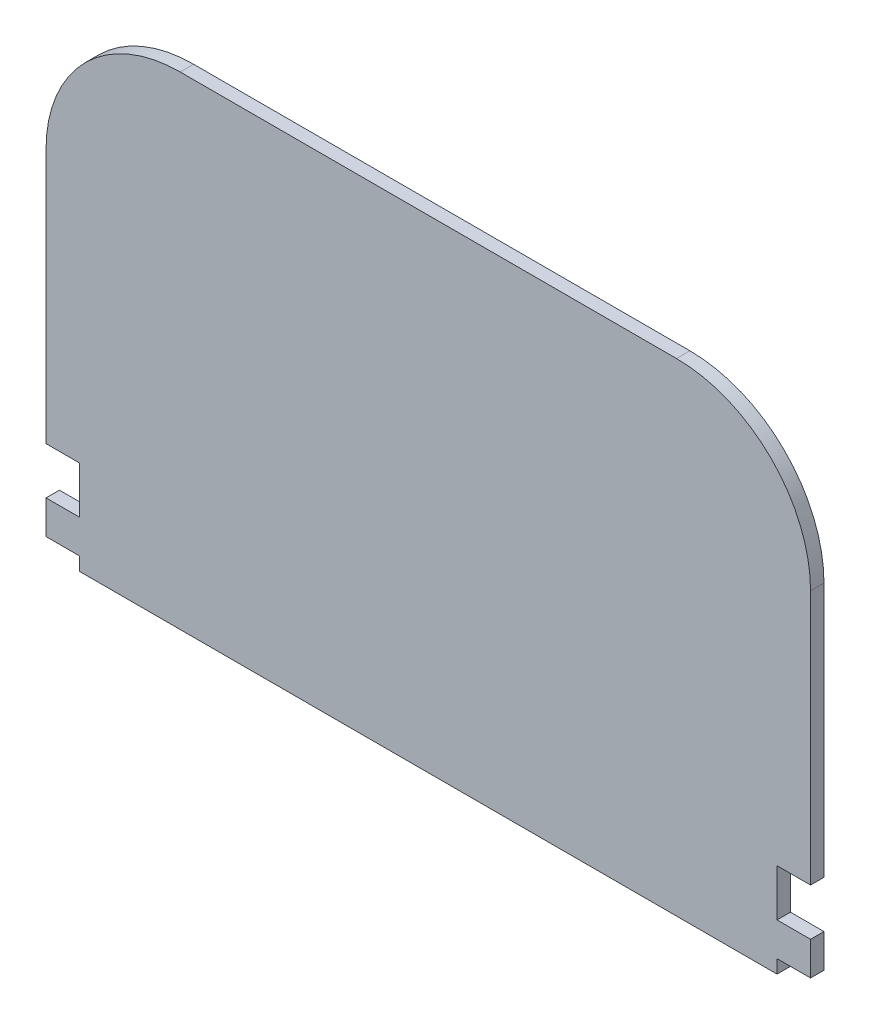
ISO-10303-21;
HEADER;
FILE_DESCRIPTION(('STEP AP214'),'2;1');
FILE_NAME('part.step','',(''),(''),'','','');
FILE_SCHEMA(('AUTOMOTIVE_DESIGN { 1 0 10303 214 1 1 1 1 }'));
ENDSEC;
DATA;
#1=APPLICATION_CONTEXT('core data for automotive mechanical design processes');
#2=APPLICATION_PROTOCOL_DEFINITION('international standard','automotive_design',2000,#1);
#3=PRODUCT_CONTEXT('',#1,'mechanical');
#4=PRODUCT('Part','Part','',(#3));
#5=PRODUCT_RELATED_PRODUCT_CATEGORY('part','',(#4));
#6=PRODUCT_DEFINITION_FORMATION('','',#4);
#7=PRODUCT_DEFINITION_CONTEXT('part definition',#1,'design');
#8=PRODUCT_DEFINITION('design','',#6,#7);
#9=PRODUCT_DEFINITION_SHAPE('','',#8);
#10=(LENGTH_UNIT() NAMED_UNIT(*) SI_UNIT(.MILLI.,.METRE.));
#11=(NAMED_UNIT(*) PLANE_ANGLE_UNIT() SI_UNIT($,.RADIAN.));
#12=(NAMED_UNIT(*) SI_UNIT($,.STERADIAN.) SOLID_ANGLE_UNIT());
#13=UNCERTAINTY_MEASURE_WITH_UNIT(LENGTH_MEASURE(1.E-05),#10,'distance_accuracy_value','');
#14=(GEOMETRIC_REPRESENTATION_CONTEXT(3) GLOBAL_UNCERTAINTY_ASSIGNED_CONTEXT((#13)) GLOBAL_UNIT_ASSIGNED_CONTEXT((#10,
#11,#12)) REPRESENTATION_CONTEXT('',''));
#15=CARTESIAN_POINT('',(0.,0.,0.));
#16=DIRECTION('',(0.,0.,1.));
#17=DIRECTION('',(1.,0.,0.));
#18=AXIS2_PLACEMENT_3D('',#15,#16,#17);
#19=CARTESIAN_POINT('',(47.,26.,1.));
#20=DIRECTION('',(0.,0.,-1.));
#21=DIRECTION('',(-1.,0.,0.));
#22=AXIS2_PLACEMENT_3D('',#19,#20,#21);
#23=CYLINDRICAL_SURFACE('',#22,10.);
#24=CARTESIAN_POINT('',(47.,26.,0.));
#25=DIRECTION('',(0.,0.,1.));
#26=DIRECTION('',(-1.,0.,0.));
#27=AXIS2_PLACEMENT_3D('',#24,#25,#26);
#28=CIRCLE('',#27,10.);
#29=CARTESIAN_POINT('',(57.,25.9999999999999,0.));
#30=VERTEX_POINT('',#29);
#31=CARTESIAN_POINT('',(46.9999999999999,36.,0.));
#32=VERTEX_POINT('',#31);
#33=EDGE_CURVE('E186',#30,#32,#28,.T.);
#34=ORIENTED_EDGE('',*,*,#33,.T.);
#35=DIRECTION('',(0.,0.,-1.));
#36=VECTOR('',#35,1.);
#37=CARTESIAN_POINT('',(46.9999999999999,36.,1.));
#38=LINE('',#37,#36);
#39=CARTESIAN_POINT('',(46.9999999999999,36.,1.));
#40=VERTEX_POINT('',#39);
#41=EDGE_CURVE('E11',#40,#32,#38,.T.);
#42=ORIENTED_EDGE('',*,*,#41,.F.);
#43=CARTESIAN_POINT('',(47.,26.,1.));
#44=DIRECTION('',(0.,0.,1.));
#45=DIRECTION('',(-1.,0.,0.));
#46=AXIS2_PLACEMENT_3D('',#43,#44,#45);
#47=CIRCLE('',#46,10.);
#48=CARTESIAN_POINT('',(57.,25.9999999999999,1.));
#49=VERTEX_POINT('',#48);
#50=EDGE_CURVE('E220',#49,#40,#47,.T.);
#51=ORIENTED_EDGE('',*,*,#50,.F.);
#52=DIRECTION('',(0.,0.,-1.));
#53=VECTOR('',#52,1.);
#54=CARTESIAN_POINT('',(57.,25.9999999999999,1.));
#55=LINE('',#54,#53);
#56=EDGE_CURVE('E182',#49,#30,#55,.T.);
#57=ORIENTED_EDGE('',*,*,#56,.T.);
#58=EDGE_LOOP('',(#34,#42,#51,#57));
#59=FACE_BOUND('',#58,.T.);
#60=ADVANCED_FACE('F30',(#59),#23,.T.);
#61=CARTESIAN_POINT('',(10.0000000000001,36.,1.));
#62=DIRECTION('',(0.,-1.,0.));
#63=DIRECTION('',(0.,0.,-1.));
#64=AXIS2_PLACEMENT_3D('',#61,#62,#63);
#65=PLANE('',#64);
#66=DIRECTION('',(-1.,0.,0.));
#67=VECTOR('',#66,1.);
#68=CARTESIAN_POINT('',(10.0000000000001,36.,0.));
#69=LINE('',#68,#67);
#70=CARTESIAN_POINT('',(10.0000000000001,36.,0.));
#71=VERTEX_POINT('',#70);
#72=EDGE_CURVE('E189',#32,#71,#69,.T.);
#73=ORIENTED_EDGE('',*,*,#72,.T.);
#74=DIRECTION('',(0.,0.,-1.));
#75=VECTOR('',#74,1.);
#76=CARTESIAN_POINT('',(10.0000000000001,36.,1.));
#77=LINE('',#76,#75);
#78=CARTESIAN_POINT('',(10.0000000000001,36.,1.));
#79=VERTEX_POINT('',#78);
#80=EDGE_CURVE('E38',#79,#71,#77,.T.);
#81=ORIENTED_EDGE('',*,*,#80,.F.);
#82=DIRECTION('',(-1.,0.,0.));
#83=VECTOR('',#82,1.);
#84=CARTESIAN_POINT('',(10.0000000000001,36.,1.));
#85=LINE('',#84,#83);
#86=EDGE_CURVE('E119',#40,#79,#85,.T.);
#87=ORIENTED_EDGE('',*,*,#86,.F.);
#88=ORIENTED_EDGE('',*,*,#41,.T.);
#89=EDGE_LOOP('',(#73,#81,#87,#88));
#90=FACE_BOUND('',#89,.T.);
#91=ADVANCED_FACE('F328',(#90),#65,.F.);
#92=CARTESIAN_POINT('',(10.,26.,1.));
#93=DIRECTION('',(0.,0.,-1.));
#94=DIRECTION('',(-1.,0.,0.));
#95=AXIS2_PLACEMENT_3D('',#92,#93,#94);
#96=CYLINDRICAL_SURFACE('',#95,10.);
#97=CARTESIAN_POINT('',(10.,26.,0.));
#98=DIRECTION('',(0.,0.,1.));
#99=DIRECTION('',(1.,0.,0.));
#100=AXIS2_PLACEMENT_3D('',#97,#98,#99);
#101=CIRCLE('',#100,10.);
#102=CARTESIAN_POINT('',(0.,25.9999999999999,0.));
#103=VERTEX_POINT('',#102);
#104=EDGE_CURVE('E191',#71,#103,#101,.T.);
#105=ORIENTED_EDGE('',*,*,#104,.T.);
#106=DIRECTION('',(0.,0.,-1.));
#107=VECTOR('',#106,1.);
#108=CARTESIAN_POINT('',(0.,25.9999999999999,1.));
#109=LINE('',#108,#107);
#110=CARTESIAN_POINT('',(0.,25.9999999999999,1.));
#111=VERTEX_POINT('',#110);
#112=EDGE_CURVE('E257',#111,#103,#109,.T.);
#113=ORIENTED_EDGE('',*,*,#112,.F.);
#114=CARTESIAN_POINT('',(10.,26.,1.));
#115=DIRECTION('',(0.,0.,1.));
#116=DIRECTION('',(1.,0.,0.));
#117=AXIS2_PLACEMENT_3D('',#114,#115,#116);
#118=CIRCLE('',#117,10.);
#119=EDGE_CURVE('E265',#79,#111,#118,.T.);
#120=ORIENTED_EDGE('',*,*,#119,.F.);
#121=ORIENTED_EDGE('',*,*,#80,.T.);
#122=EDGE_LOOP('',(#105,#113,#120,#121));
#123=FACE_BOUND('',#122,.T.);
#124=ADVANCED_FACE('F263',(#123),#96,.T.);
#125=CARTESIAN_POINT('',(0.,7.,1.));
#126=DIRECTION('',(1.,0.,0.));
#127=DIRECTION('',(0.,0.,-1.));
#128=AXIS2_PLACEMENT_3D('',#125,#126,#127);
#129=PLANE('',#128);
#130=DIRECTION('',(0.,-1.,0.));
#131=VECTOR('',#130,1.);
#132=CARTESIAN_POINT('',(0.,7.,0.));
#133=LINE('',#132,#131);
#134=CARTESIAN_POINT('',(0.,7.,0.));
#135=VERTEX_POINT('',#134);
#136=EDGE_CURVE('E193',#103,#135,#133,.T.);
#137=ORIENTED_EDGE('',*,*,#136,.T.);
#138=DIRECTION('',(0.,0.,-1.));
#139=VECTOR('',#138,1.);
#140=CARTESIAN_POINT('',(0.,7.,1.));
#141=LINE('',#140,#139);
#142=CARTESIAN_POINT('',(0.,7.,1.));
#143=VERTEX_POINT('',#142);
#144=EDGE_CURVE('E254',#143,#135,#141,.T.);
#145=ORIENTED_EDGE('',*,*,#144,.F.);
#146=DIRECTION('',(0.,-1.,0.));
#147=VECTOR('',#146,1.);
#148=CARTESIAN_POINT('',(0.,7.,1.));
#149=LINE('',#148,#147);
#150=EDGE_CURVE('E283',#111,#143,#149,.T.);
#151=ORIENTED_EDGE('',*,*,#150,.F.);
#152=ORIENTED_EDGE('',*,*,#112,.T.);
#153=EDGE_LOOP('',(#137,#145,#151,#152));
#154=FACE_BOUND('',#153,.T.);
#155=ADVANCED_FACE('F274',(#154),#129,.F.);
#156=CARTESIAN_POINT('',(0.,7.,1.));
#157=DIRECTION('',(0.,1.,0.));
#158=DIRECTION('',(0.,0.,1.));
#159=AXIS2_PLACEMENT_3D('',#156,#157,#158);
#160=PLANE('',#159);
#161=DIRECTION('',(1.,0.,0.));
#162=VECTOR('',#161,1.);
#163=CARTESIAN_POINT('',(0.,7.,0.));
#164=LINE('',#163,#162);
#165=CARTESIAN_POINT('',(2.5,7.,0.));
#166=VERTEX_POINT('',#165);
#167=EDGE_CURVE('E195',#135,#166,#164,.T.);
#168=ORIENTED_EDGE('',*,*,#167,.T.);
#169=DIRECTION('',(0.,0.,-1.));
#170=VECTOR('',#169,1.);
#171=CARTESIAN_POINT('',(2.5,7.,1.));
#172=LINE('',#171,#170);
#173=CARTESIAN_POINT('',(2.5,7.,1.));
#174=VERTEX_POINT('',#173);
#175=EDGE_CURVE('E251',#174,#166,#172,.T.);
#176=ORIENTED_EDGE('',*,*,#175,.F.);
#177=DIRECTION('',(1.,0.,0.));
#178=VECTOR('',#177,1.);
#179=CARTESIAN_POINT('',(0.,7.,1.));
#180=LINE('',#179,#178);
#181=EDGE_CURVE('E280',#143,#174,#180,.T.);
#182=ORIENTED_EDGE('',*,*,#181,.F.);
#183=ORIENTED_EDGE('',*,*,#144,.T.);
#184=EDGE_LOOP('',(#168,#176,#182,#183));
#185=FACE_BOUND('',#184,.T.);
#186=ADVANCED_FACE('F278',(#185),#160,.F.);
#187=CARTESIAN_POINT('',(2.5,3.5,1.));
#188=DIRECTION('',(1.,0.,0.));
#189=DIRECTION('',(0.,0.,-1.));
#190=AXIS2_PLACEMENT_3D('',#187,#188,#189);
#191=PLANE('',#190);
#192=DIRECTION('',(0.,-1.,0.));
#193=VECTOR('',#192,1.);
#194=CARTESIAN_POINT('',(2.5,3.5,0.));
#195=LINE('',#194,#193);
#196=CARTESIAN_POINT('',(2.5,3.5,0.));
#197=VERTEX_POINT('',#196);
#198=EDGE_CURVE('E197',#166,#197,#195,.T.);
#199=ORIENTED_EDGE('',*,*,#198,.T.);
#200=DIRECTION('',(0.,0.,-1.));
#201=VECTOR('',#200,1.);
#202=CARTESIAN_POINT('',(2.5,3.5,1.));
#203=LINE('',#202,#201);
#204=CARTESIAN_POINT('',(2.5,3.5,1.));
#205=VERTEX_POINT('',#204);
#206=EDGE_CURVE('E248',#205,#197,#203,.T.);
#207=ORIENTED_EDGE('',*,*,#206,.F.);
#208=DIRECTION('',(0.,-1.,0.));
#209=VECTOR('',#208,1.);
#210=CARTESIAN_POINT('',(2.5,3.5,1.));
#211=LINE('',#210,#209);
#212=EDGE_CURVE('E282',#174,#205,#211,.T.);
#213=ORIENTED_EDGE('',*,*,#212,.F.);
#214=ORIENTED_EDGE('',*,*,#175,.T.);
#215=EDGE_LOOP('',(#199,#207,#213,#214));
#216=FACE_BOUND('',#215,.T.);
#217=ADVANCED_FACE('F341',(#216),#191,.F.);
#218=CARTESIAN_POINT('',(0.,3.5,1.));
#219=DIRECTION('',(0.,-1.,0.));
#220=DIRECTION('',(0.,0.,-1.));
#221=AXIS2_PLACEMENT_3D('',#218,#219,#220);
#222=PLANE('',#221);
#223=DIRECTION('',(-1.,0.,0.));
#224=VECTOR('',#223,1.);
#225=CARTESIAN_POINT('',(0.,3.5,0.));
#226=LINE('',#225,#224);
#227=CARTESIAN_POINT('',(0.,3.5,0.));
#228=VERTEX_POINT('',#227);
#229=EDGE_CURVE('E199',#197,#228,#226,.T.);
#230=ORIENTED_EDGE('',*,*,#229,.T.);
#231=DIRECTION('',(0.,0.,-1.));
#232=VECTOR('',#231,1.);
#233=CARTESIAN_POINT('',(0.,3.5,1.));
#234=LINE('',#233,#232);
#235=CARTESIAN_POINT('',(0.,3.5,1.));
#236=VERTEX_POINT('',#235);
#237=EDGE_CURVE('E245',#236,#228,#234,.T.);
#238=ORIENTED_EDGE('',*,*,#237,.F.);
#239=DIRECTION('',(-1.,0.,0.));
#240=VECTOR('',#239,1.);
#241=CARTESIAN_POINT('',(0.,3.5,1.));
#242=LINE('',#241,#240);
#243=EDGE_CURVE('E285',#205,#236,#242,.T.);
#244=ORIENTED_EDGE('',*,*,#243,.F.);
#245=ORIENTED_EDGE('',*,*,#206,.T.);
#246=EDGE_LOOP('',(#230,#238,#244,#245));
#247=FACE_BOUND('',#246,.T.);
#248=ADVANCED_FACE('F344',(#247),#222,.F.);
#249=CARTESIAN_POINT('',(0.,1.,1.));
#250=DIRECTION('',(1.,0.,0.));
#251=DIRECTION('',(0.,0.,-1.));
#252=AXIS2_PLACEMENT_3D('',#249,#250,#251);
#253=PLANE('',#252);
#254=DIRECTION('',(0.,-1.,0.));
#255=VECTOR('',#254,1.);
#256=CARTESIAN_POINT('',(0.,1.,0.));
#257=LINE('',#256,#255);
#258=CARTESIAN_POINT('',(0.,1.,0.));
#259=VERTEX_POINT('',#258);
#260=EDGE_CURVE('E201',#228,#259,#257,.T.);
#261=ORIENTED_EDGE('',*,*,#260,.T.);
#262=DIRECTION('',(0.,0.,-1.));
#263=VECTOR('',#262,1.);
#264=CARTESIAN_POINT('',(0.,1.,1.));
#265=LINE('',#264,#263);
#266=CARTESIAN_POINT('',(0.,1.,1.));
#267=VERTEX_POINT('',#266);
#268=EDGE_CURVE('E242',#267,#259,#265,.T.);
#269=ORIENTED_EDGE('',*,*,#268,.F.);
#270=DIRECTION('',(0.,-1.,0.));
#271=VECTOR('',#270,1.);
#272=CARTESIAN_POINT('',(0.,1.,1.));
#273=LINE('',#272,#271);
#274=EDGE_CURVE('E291',#236,#267,#273,.T.);
#275=ORIENTED_EDGE('',*,*,#274,.F.);
#276=ORIENTED_EDGE('',*,*,#237,.T.);
#277=EDGE_LOOP('',(#261,#269,#275,#276));
#278=FACE_BOUND('',#277,.T.);
#279=ADVANCED_FACE('F348',(#278),#253,.F.);
#280=CARTESIAN_POINT('',(0.,1.,1.));
#281=DIRECTION('',(0.,1.,0.));
#282=DIRECTION('',(0.,0.,1.));
#283=AXIS2_PLACEMENT_3D('',#280,#281,#282);
#284=PLANE('',#283);
#285=DIRECTION('',(1.,0.,0.));
#286=VECTOR('',#285,1.);
#287=CARTESIAN_POINT('',(0.,1.,0.));
#288=LINE('',#287,#286);
#289=CARTESIAN_POINT('',(2.5,1.,0.));
#290=VERTEX_POINT('',#289);
#291=EDGE_CURVE('E203',#259,#290,#288,.T.);
#292=ORIENTED_EDGE('',*,*,#291,.T.);
#293=DIRECTION('',(0.,0.,-1.));
#294=VECTOR('',#293,1.);
#295=CARTESIAN_POINT('',(2.5,1.,1.));
#296=LINE('',#295,#294);
#297=CARTESIAN_POINT('',(2.5,1.,1.));
#298=VERTEX_POINT('',#297);
#299=EDGE_CURVE('E239',#298,#290,#296,.T.);
#300=ORIENTED_EDGE('',*,*,#299,.F.);
#301=DIRECTION('',(1.,0.,0.));
#302=VECTOR('',#301,1.);
#303=CARTESIAN_POINT('',(0.,1.,1.));
#304=LINE('',#303,#302);
#305=EDGE_CURVE('E293',#267,#298,#304,.T.);
#306=ORIENTED_EDGE('',*,*,#305,.F.);
#307=ORIENTED_EDGE('',*,*,#268,.T.);
#308=EDGE_LOOP('',(#292,#300,#306,#307));
#309=FACE_BOUND('',#308,.T.);
#310=ADVANCED_FACE('F352',(#309),#284,.F.);
#311=CARTESIAN_POINT('',(2.5,0.,1.));
#312=DIRECTION('',(1.,0.,0.));
#313=DIRECTION('',(0.,1.,0.));
#314=AXIS2_PLACEMENT_3D('',#311,#312,#313);
#315=PLANE('',#314);
#316=DIRECTION('',(0.,-1.,0.));
#317=VECTOR('',#316,1.);
#318=CARTESIAN_POINT('',(2.5,0.,0.));
#319=LINE('',#318,#317);
#320=CARTESIAN_POINT('',(2.5,0.,0.));
#321=VERTEX_POINT('',#320);
#322=EDGE_CURVE('E205',#290,#321,#319,.T.);
#323=ORIENTED_EDGE('',*,*,#322,.T.);
#324=DIRECTION('',(0.,0.,-1.));
#325=VECTOR('',#324,1.);
#326=CARTESIAN_POINT('',(2.5,0.,1.));
#327=LINE('',#326,#325);
#328=CARTESIAN_POINT('',(2.5,0.,1.));
#329=VERTEX_POINT('',#328);
#330=EDGE_CURVE('E236',#329,#321,#327,.T.);
#331=ORIENTED_EDGE('',*,*,#330,.F.);
#332=DIRECTION('',(0.,-1.,0.));
#333=VECTOR('',#332,1.);
#334=CARTESIAN_POINT('',(2.5,0.,1.));
#335=LINE('',#334,#333);
#336=EDGE_CURVE('E295',#298,#329,#335,.T.);
#337=ORIENTED_EDGE('',*,*,#336,.F.);
#338=ORIENTED_EDGE('',*,*,#299,.T.);
#339=EDGE_LOOP('',(#323,#331,#337,#338));
#340=FACE_BOUND('',#339,.T.);
#341=ADVANCED_FACE('F356',(#340),#315,.F.);
#342=CARTESIAN_POINT('',(2.5,0.,1.));
#343=DIRECTION('',(0.,1.,0.));
#344=DIRECTION('',(0.,0.,1.));
#345=AXIS2_PLACEMENT_3D('',#342,#343,#344);
#346=PLANE('',#345);
#347=DIRECTION('',(1.,0.,0.));
#348=VECTOR('',#347,1.);
#349=CARTESIAN_POINT('',(2.5,0.,0.));
#350=LINE('',#349,#348);
#351=CARTESIAN_POINT('',(54.5,0.,0.));
#352=VERTEX_POINT('',#351);
#353=EDGE_CURVE('E207',#321,#352,#350,.T.);
#354=ORIENTED_EDGE('',*,*,#353,.T.);
#355=DIRECTION('',(0.,0.,-1.));
#356=VECTOR('',#355,1.);
#357=CARTESIAN_POINT('',(54.5,0.,1.));
#358=LINE('',#357,#356);
#359=CARTESIAN_POINT('',(54.5,0.,1.));
#360=VERTEX_POINT('',#359);
#361=EDGE_CURVE('E233',#360,#352,#358,.T.);
#362=ORIENTED_EDGE('',*,*,#361,.F.);
#363=DIRECTION('',(1.,0.,0.));
#364=VECTOR('',#363,1.);
#365=CARTESIAN_POINT('',(2.5,0.,1.));
#366=LINE('',#365,#364);
#367=EDGE_CURVE('E297',#329,#360,#366,.T.);
#368=ORIENTED_EDGE('',*,*,#367,.F.);
#369=ORIENTED_EDGE('',*,*,#330,.T.);
#370=EDGE_LOOP('',(#354,#362,#368,#369));
#371=FACE_BOUND('',#370,.T.);
#372=ADVANCED_FACE('F360',(#371),#346,.F.);
#373=CARTESIAN_POINT('',(54.5,0.,1.));
#374=DIRECTION('',(-1.,0.,0.));
#375=DIRECTION('',(0.,-1.,0.));
#376=AXIS2_PLACEMENT_3D('',#373,#374,#375);
#377=PLANE('',#376);
#378=DIRECTION('',(0.,1.,0.));
#379=VECTOR('',#378,1.);
#380=CARTESIAN_POINT('',(54.5,0.,0.));
#381=LINE('',#380,#379);
#382=CARTESIAN_POINT('',(54.5,1.,0.));
#383=VERTEX_POINT('',#382);
#384=EDGE_CURVE('E209',#352,#383,#381,.T.);
#385=ORIENTED_EDGE('',*,*,#384,.T.);
#386=DIRECTION('',(0.,0.,-1.));
#387=VECTOR('',#386,1.);
#388=CARTESIAN_POINT('',(54.5,1.,1.));
#389=LINE('',#388,#387);
#390=CARTESIAN_POINT('',(54.5,1.,1.));
#391=VERTEX_POINT('',#390);
#392=EDGE_CURVE('E230',#391,#383,#389,.T.);
#393=ORIENTED_EDGE('',*,*,#392,.F.);
#394=DIRECTION('',(0.,1.,0.));
#395=VECTOR('',#394,1.);
#396=CARTESIAN_POINT('',(54.5,0.,1.));
#397=LINE('',#396,#395);
#398=EDGE_CURVE('E299',#360,#391,#397,.T.);
#399=ORIENTED_EDGE('',*,*,#398,.F.);
#400=ORIENTED_EDGE('',*,*,#361,.T.);
#401=EDGE_LOOP('',(#385,#393,#399,#400));
#402=FACE_BOUND('',#401,.T.);
#403=ADVANCED_FACE('F364',(#402),#377,.F.);
#404=CARTESIAN_POINT('',(54.5,1.,1.));
#405=DIRECTION('',(0.,1.,0.));
#406=DIRECTION('',(0.,0.,1.));
#407=AXIS2_PLACEMENT_3D('',#404,#405,#406);
#408=PLANE('',#407);
#409=DIRECTION('',(1.,0.,0.));
#410=VECTOR('',#409,1.);
#411=CARTESIAN_POINT('',(54.5,1.,0.));
#412=LINE('',#411,#410);
#413=CARTESIAN_POINT('',(57.,1.,0.));
#414=VERTEX_POINT('',#413);
#415=EDGE_CURVE('E211',#383,#414,#412,.T.);
#416=ORIENTED_EDGE('',*,*,#415,.T.);
#417=DIRECTION('',(0.,0.,-1.));
#418=VECTOR('',#417,1.);
#419=CARTESIAN_POINT('',(57.,1.,1.));
#420=LINE('',#419,#418);
#421=CARTESIAN_POINT('',(57.,1.,1.));
#422=VERTEX_POINT('',#421);
#423=EDGE_CURVE('E227',#422,#414,#420,.T.);
#424=ORIENTED_EDGE('',*,*,#423,.F.);
#425=DIRECTION('',(1.,0.,0.));
#426=VECTOR('',#425,1.);
#427=CARTESIAN_POINT('',(54.5,1.,1.));
#428=LINE('',#427,#426);
#429=EDGE_CURVE('E301',#391,#422,#428,.T.);
#430=ORIENTED_EDGE('',*,*,#429,.F.);
#431=ORIENTED_EDGE('',*,*,#392,.T.);
#432=EDGE_LOOP('',(#416,#424,#430,#431));
#433=FACE_BOUND('',#432,.T.);
#434=ADVANCED_FACE('F368',(#433),#408,.F.);
#435=CARTESIAN_POINT('',(57.,1.,1.));
#436=DIRECTION('',(-1.,0.,0.));
#437=DIRECTION('',(0.,0.,1.));
#438=AXIS2_PLACEMENT_3D('',#435,#436,#437);
#439=PLANE('',#438);
#440=DIRECTION('',(0.,1.,0.));
#441=VECTOR('',#440,1.);
#442=CARTESIAN_POINT('',(57.,1.,0.));
#443=LINE('',#442,#441);
#444=CARTESIAN_POINT('',(57.,3.5,0.));
#445=VERTEX_POINT('',#444);
#446=EDGE_CURVE('E213',#414,#445,#443,.T.);
#447=ORIENTED_EDGE('',*,*,#446,.T.);
#448=DIRECTION('',(0.,0.,-1.));
#449=VECTOR('',#448,1.);
#450=CARTESIAN_POINT('',(57.,3.5,1.));
#451=LINE('',#450,#449);
#452=CARTESIAN_POINT('',(57.,3.5,1.));
#453=VERTEX_POINT('',#452);
#454=EDGE_CURVE('E224',#453,#445,#451,.T.);
#455=ORIENTED_EDGE('',*,*,#454,.F.);
#456=DIRECTION('',(0.,1.,0.));
#457=VECTOR('',#456,1.);
#458=CARTESIAN_POINT('',(57.,1.,1.));
#459=LINE('',#458,#457);
#460=EDGE_CURVE('E303',#422,#453,#459,.T.);
#461=ORIENTED_EDGE('',*,*,#460,.F.);
#462=ORIENTED_EDGE('',*,*,#423,.T.);
#463=EDGE_LOOP('',(#447,#455,#461,#462));
#464=FACE_BOUND('',#463,.T.);
#465=ADVANCED_FACE('F309',(#464),#439,.F.);
#466=CARTESIAN_POINT('',(54.5,3.5,1.));
#467=DIRECTION('',(0.,-1.,0.));
#468=DIRECTION('',(0.,0.,-1.));
#469=AXIS2_PLACEMENT_3D('',#466,#467,#468);
#470=PLANE('',#469);
#471=DIRECTION('',(-1.,0.,0.));
#472=VECTOR('',#471,1.);
#473=CARTESIAN_POINT('',(54.5,3.5,0.));
#474=LINE('',#473,#472);
#475=CARTESIAN_POINT('',(54.5,3.5,0.));
#476=VERTEX_POINT('',#475);
#477=EDGE_CURVE('E215',#445,#476,#474,.T.);
#478=ORIENTED_EDGE('',*,*,#477,.T.);
#479=DIRECTION('',(0.,0.,-1.));
#480=VECTOR('',#479,1.);
#481=CARTESIAN_POINT('',(54.5,3.5,1.));
#482=LINE('',#481,#480);
#483=CARTESIAN_POINT('',(54.5,3.5,1.));
#484=VERTEX_POINT('',#483);
#485=EDGE_CURVE('E177',#484,#476,#482,.T.);
#486=ORIENTED_EDGE('',*,*,#485,.F.);
#487=DIRECTION('',(-1.,0.,0.));
#488=VECTOR('',#487,1.);
#489=CARTESIAN_POINT('',(54.5,3.5,1.));
#490=LINE('',#489,#488);
#491=EDGE_CURVE('E168',#453,#484,#490,.T.);
#492=ORIENTED_EDGE('',*,*,#491,.F.);
#493=ORIENTED_EDGE('',*,*,#454,.T.);
#494=EDGE_LOOP('',(#478,#486,#492,#493));
#495=FACE_BOUND('',#494,.T.);
#496=ADVANCED_FACE('F313',(#495),#470,.F.);
#497=CARTESIAN_POINT('',(54.5,3.5,1.));
#498=DIRECTION('',(-1.,0.,0.));
#499=DIRECTION('',(0.,0.,1.));
#500=AXIS2_PLACEMENT_3D('',#497,#498,#499);
#501=PLANE('',#500);
#502=DIRECTION('',(0.,1.,0.));
#503=VECTOR('',#502,1.);
#504=CARTESIAN_POINT('',(54.5,3.5,0.));
#505=LINE('',#504,#503);
#506=CARTESIAN_POINT('',(54.5,7.,0.));
#507=VERTEX_POINT('',#506);
#508=EDGE_CURVE('E176',#476,#507,#505,.T.);
#509=ORIENTED_EDGE('',*,*,#508,.T.);
#510=DIRECTION('',(0.,0.,-1.));
#511=VECTOR('',#510,1.);
#512=CARTESIAN_POINT('',(54.5,7.,1.));
#513=LINE('',#512,#511);
#514=CARTESIAN_POINT('',(54.5,7.,1.));
#515=VERTEX_POINT('',#514);
#516=EDGE_CURVE('E173',#515,#507,#513,.T.);
#517=ORIENTED_EDGE('',*,*,#516,.F.);
#518=DIRECTION('',(0.,1.,0.));
#519=VECTOR('',#518,1.);
#520=CARTESIAN_POINT('',(54.5,3.5,1.));
#521=LINE('',#520,#519);
#522=EDGE_CURVE('E162',#484,#515,#521,.T.);
#523=ORIENTED_EDGE('',*,*,#522,.F.);
#524=ORIENTED_EDGE('',*,*,#485,.T.);
#525=EDGE_LOOP('',(#509,#517,#523,#524));
#526=FACE_BOUND('',#525,.T.);
#527=ADVANCED_FACE('F174',(#526),#501,.F.);
#528=CARTESIAN_POINT('',(54.5,7.,1.));
#529=DIRECTION('',(0.,1.,0.));
#530=DIRECTION('',(0.,0.,1.));
#531=AXIS2_PLACEMENT_3D('',#528,#529,#530);
#532=PLANE('',#531);
#533=DIRECTION('',(1.,0.,0.));
#534=VECTOR('',#533,1.);
#535=CARTESIAN_POINT('',(54.5,7.,0.));
#536=LINE('',#535,#534);
#537=CARTESIAN_POINT('',(57.,7.,0.));
#538=VERTEX_POINT('',#537);
#539=EDGE_CURVE('E105',#507,#538,#536,.T.);
#540=ORIENTED_EDGE('',*,*,#539,.T.);
#541=DIRECTION('',(0.,0.,-1.));
#542=VECTOR('',#541,1.);
#543=CARTESIAN_POINT('',(57.,7.,1.));
#544=LINE('',#543,#542);
#545=CARTESIAN_POINT('',(57.,7.,1.));
#546=VERTEX_POINT('',#545);
#547=EDGE_CURVE('E178',#546,#538,#544,.T.);
#548=ORIENTED_EDGE('',*,*,#547,.F.);
#549=DIRECTION('',(1.,0.,0.));
#550=VECTOR('',#549,1.);
#551=CARTESIAN_POINT('',(54.5,7.,1.));
#552=LINE('',#551,#550);
#553=EDGE_CURVE('E166',#515,#546,#552,.T.);
#554=ORIENTED_EDGE('',*,*,#553,.F.);
#555=ORIENTED_EDGE('',*,*,#516,.T.);
#556=EDGE_LOOP('',(#540,#548,#554,#555));
#557=FACE_BOUND('',#556,.T.);
#558=ADVANCED_FACE('F180',(#557),#532,.F.);
#559=CARTESIAN_POINT('',(57.,7.,1.));
#560=DIRECTION('',(-1.,0.,0.));
#561=DIRECTION('',(0.,0.,1.));
#562=AXIS2_PLACEMENT_3D('',#559,#560,#561);
#563=PLANE('',#562);
#564=DIRECTION('',(0.,1.,0.));
#565=VECTOR('',#564,1.);
#566=CARTESIAN_POINT('',(57.,7.,0.));
#567=LINE('',#566,#565);
#568=EDGE_CURVE('E111',#538,#30,#567,.T.);
#569=ORIENTED_EDGE('',*,*,#568,.T.);
#570=ORIENTED_EDGE('',*,*,#56,.F.);
#571=DIRECTION('',(0.,1.,0.));
#572=VECTOR('',#571,1.);
#573=CARTESIAN_POINT('',(57.,7.,1.));
#574=LINE('',#573,#572);
#575=EDGE_CURVE('E46',#546,#49,#574,.T.);
#576=ORIENTED_EDGE('',*,*,#575,.F.);
#577=ORIENTED_EDGE('',*,*,#547,.T.);
#578=EDGE_LOOP('',(#569,#570,#576,#577));
#579=FACE_BOUND('',#578,.T.);
#580=ADVANCED_FACE('F317',(#579),#563,.F.);
#581=CARTESIAN_POINT('',(47.,26.,1.));
#582=DIRECTION('',(0.,0.,-1.));
#583=DIRECTION('',(-1.,0.,0.));
#584=AXIS2_PLACEMENT_3D('',#581,#582,#583);
#585=PLANE('',#584);
#586=ORIENTED_EDGE('',*,*,#50,.T.);
#587=ORIENTED_EDGE('',*,*,#86,.T.);
#588=ORIENTED_EDGE('',*,*,#119,.T.);
#589=ORIENTED_EDGE('',*,*,#150,.T.);
#590=ORIENTED_EDGE('',*,*,#181,.T.);
#591=ORIENTED_EDGE('',*,*,#212,.T.);
#592=ORIENTED_EDGE('',*,*,#243,.T.);
#593=ORIENTED_EDGE('',*,*,#274,.T.);
#594=ORIENTED_EDGE('',*,*,#305,.T.);
#595=ORIENTED_EDGE('',*,*,#336,.T.);
#596=ORIENTED_EDGE('',*,*,#367,.T.);
#597=ORIENTED_EDGE('',*,*,#398,.T.);
#598=ORIENTED_EDGE('',*,*,#429,.T.);
#599=ORIENTED_EDGE('',*,*,#460,.T.);
#600=ORIENTED_EDGE('',*,*,#491,.T.);
#601=ORIENTED_EDGE('',*,*,#522,.T.);
#602=ORIENTED_EDGE('',*,*,#553,.T.);
#603=ORIENTED_EDGE('',*,*,#575,.T.);
#604=EDGE_LOOP('',(#586,#587,#588,#589,#590,#591,#592,#593,#594,#595,#596,#597,#598,#599,#600,
#601,#602,#603));
#605=FACE_BOUND('',#604,.T.);
#606=ADVANCED_FACE('F164',(#605),#585,.F.);
#607=CARTESIAN_POINT('',(47.,26.,0.));
#608=DIRECTION('',(0.,0.,-1.));
#609=DIRECTION('',(-1.,0.,0.));
#610=AXIS2_PLACEMENT_3D('',#607,#608,#609);
#611=PLANE('',#610);
#612=ORIENTED_EDGE('',*,*,#33,.F.);
#613=ORIENTED_EDGE('',*,*,#568,.F.);
#614=ORIENTED_EDGE('',*,*,#539,.F.);
#615=ORIENTED_EDGE('',*,*,#508,.F.);
#616=ORIENTED_EDGE('',*,*,#477,.F.);
#617=ORIENTED_EDGE('',*,*,#446,.F.);
#618=ORIENTED_EDGE('',*,*,#415,.F.);
#619=ORIENTED_EDGE('',*,*,#384,.F.);
#620=ORIENTED_EDGE('',*,*,#353,.F.);
#621=ORIENTED_EDGE('',*,*,#322,.F.);
#622=ORIENTED_EDGE('',*,*,#291,.F.);
#623=ORIENTED_EDGE('',*,*,#260,.F.);
#624=ORIENTED_EDGE('',*,*,#229,.F.);
#625=ORIENTED_EDGE('',*,*,#198,.F.);
#626=ORIENTED_EDGE('',*,*,#167,.F.);
#627=ORIENTED_EDGE('',*,*,#136,.F.);
#628=ORIENTED_EDGE('',*,*,#104,.F.);
#629=ORIENTED_EDGE('',*,*,#72,.F.);
#630=EDGE_LOOP('',(#612,#613,#614,#615,#616,#617,#618,#619,#620,#621,#622,#623,#624,#625,#626,
#627,#628,#629));
#631=FACE_BOUND('',#630,.T.);
#632=ADVANCED_FACE('F269',(#631),#611,.T.);
#633=CLOSED_SHELL('',(#60,#91,#124,#155,#186,#217,#248,#279,#310,#341,#372,#403,#434,#465,#496,
#527,#558,#580,#606,#632));
#634=MANIFOLD_SOLID_BREP('B2',#633);
#635=ADVANCED_BREP_SHAPE_REPRESENTATION('',(#18,#634),#14);
#636=SHAPE_DEFINITION_REPRESENTATION(#9,#635);
ENDSEC;
END-ISO-10303-21;
